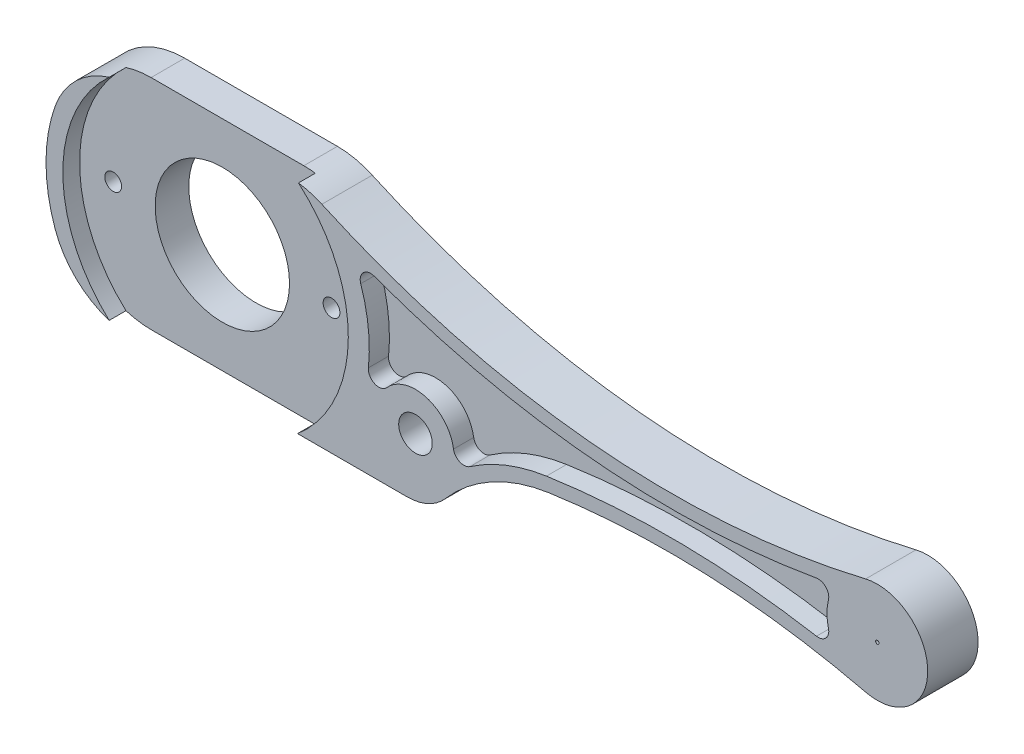
ISO-10303-21;
HEADER;
FILE_DESCRIPTION(('STEP AP214'),'2;1');
FILE_NAME('part.step','',(''),(''),'','','');
FILE_SCHEMA(('AUTOMOTIVE_DESIGN { 1 0 10303 214 1 1 1 1 }'));
ENDSEC;
DATA;
#1=APPLICATION_CONTEXT('core data for automotive mechanical design processes');
#2=APPLICATION_PROTOCOL_DEFINITION('international standard','automotive_design',2000,#1);
#3=PRODUCT_CONTEXT('',#1,'mechanical');
#4=PRODUCT('Part','Part','',(#3));
#5=PRODUCT_RELATED_PRODUCT_CATEGORY('part','',(#4));
#6=PRODUCT_DEFINITION_FORMATION('','',#4);
#7=PRODUCT_DEFINITION_CONTEXT('part definition',#1,'design');
#8=PRODUCT_DEFINITION('design','',#6,#7);
#9=PRODUCT_DEFINITION_SHAPE('','',#8);
#10=(LENGTH_UNIT() NAMED_UNIT(*) SI_UNIT(.MILLI.,.METRE.));
#11=(NAMED_UNIT(*) PLANE_ANGLE_UNIT() SI_UNIT($,.RADIAN.));
#12=(NAMED_UNIT(*) SI_UNIT($,.STERADIAN.) SOLID_ANGLE_UNIT());
#13=UNCERTAINTY_MEASURE_WITH_UNIT(LENGTH_MEASURE(1.E-05),#10,'distance_accuracy_value','');
#14=(GEOMETRIC_REPRESENTATION_CONTEXT(3) GLOBAL_UNCERTAINTY_ASSIGNED_CONTEXT((#13)) GLOBAL_UNIT_ASSIGNED_CONTEXT((#10,
#11,#12)) REPRESENTATION_CONTEXT('',''));
#15=CARTESIAN_POINT('',(0.,0.,0.));
#16=DIRECTION('',(0.,0.,1.));
#17=DIRECTION('',(1.,0.,0.));
#18=AXIS2_PLACEMENT_3D('',#15,#16,#17);
#19=CARTESIAN_POINT('',(-15.,-15.,6.));
#20=DIRECTION('',(0.,0.,-1.));
#21=DIRECTION('',(1.,0.,0.));
#22=AXIS2_PLACEMENT_3D('',#19,#20,#21);
#23=PLANE('',#22);
#24=CARTESIAN_POINT('',(0.,0.,6.));
#25=DIRECTION('',(0.,0.,1.));
#26=DIRECTION('',(1.,0.,0.));
#27=AXIS2_PLACEMENT_3D('',#24,#25,#26);
#28=CIRCLE('',#27,9.5);
#29=CARTESIAN_POINT('',(-8.9566858950296,3.16666666666667,6.));
#30=VERTEX_POINT('',#29);
#31=CARTESIAN_POINT('',(-8.9566858950296,-3.16666666666667,6.));
#32=VERTEX_POINT('',#31);
#33=EDGE_CURVE('E274',#30,#32,#28,.T.);
#34=ORIENTED_EDGE('',*,*,#33,.T.);
#35=CARTESIAN_POINT('',(-4.24264068711928,-1.5,6.));
#36=DIRECTION('',(0.,0.,1.));
#37=DIRECTION('',(-1.,0.,0.));
#38=AXIS2_PLACEMENT_3D('',#35,#36,#37);
#39=CIRCLE('',#38,5.);
#40=CARTESIAN_POINT('',(-5.73773447853214,-6.27123616632825,6.));
#41=VERTEX_POINT('',#40);
#42=EDGE_CURVE('E277',#32,#41,#39,.T.);
#43=ORIENTED_EDGE('',*,*,#42,.T.);
#44=CARTESIAN_POINT('',(0.,0.,6.));
#45=DIRECTION('',(0.,0.,1.));
#46=DIRECTION('',(1.,0.,0.));
#47=AXIS2_PLACEMENT_3D('',#44,#45,#46);
#48=CIRCLE('',#47,8.5);
#49=CARTESIAN_POINT('',(-5.73773447853214,6.27123616632825,6.));
#50=VERTEX_POINT('',#49);
#51=EDGE_CURVE('E331',#50,#41,#48,.T.);
#52=ORIENTED_EDGE('',*,*,#51,.F.);
#53=CARTESIAN_POINT('',(-4.24264068711928,1.5,6.));
#54=DIRECTION('',(0.,0.,1.));
#55=DIRECTION('',(1.,0.,0.));
#56=AXIS2_PLACEMENT_3D('',#53,#54,#55);
#57=CIRCLE('',#56,5.);
#58=EDGE_CURVE('E271',#50,#30,#57,.T.);
#59=ORIENTED_EDGE('',*,*,#58,.T.);
#60=EDGE_LOOP('',(#34,#43,#52,#59));
#61=FACE_BOUND('',#60,.T.);
#62=ADVANCED_FACE('F33',(#61),#23,.F.);
#63=CARTESIAN_POINT('',(0.,0.,5.));
#64=DIRECTION('',(0.,0.,1.));
#65=DIRECTION('',(-1.,0.,0.));
#66=AXIS2_PLACEMENT_3D('',#63,#64,#65);
#67=CYLINDRICAL_SURFACE('',#66,8.5);
#68=DIRECTION('',(0.,0.,1.));
#69=VECTOR('',#68,1.);
#70=CARTESIAN_POINT('',(5.53211423569837,6.45334890449784,4.5));
#71=LINE('',#70,#69);
#72=CARTESIAN_POINT('',(5.53211423569837,6.45334890449784,6.));
#73=VERTEX_POINT('',#72);
#74=CARTESIAN_POINT('',(5.53211423569837,6.45334890449784,5.));
#75=VERTEX_POINT('',#74);
#76=EDGE_CURVE('E41',#73,#75,#71,.F.);
#77=ORIENTED_EDGE('',*,*,#76,.T.);
#78=CARTESIAN_POINT('',(0.,0.,5.));
#79=DIRECTION('',(0.,0.,1.));
#80=DIRECTION('',(1.,0.,0.));
#81=AXIS2_PLACEMENT_3D('',#78,#79,#80);
#82=CIRCLE('',#81,8.5);
#83=CARTESIAN_POINT('',(5.47722557505166,-6.5,5.));
#84=VERTEX_POINT('',#83);
#85=EDGE_CURVE('E327',#84,#75,#82,.T.);
#86=ORIENTED_EDGE('',*,*,#85,.F.);
#87=DIRECTION('',(0.,0.,1.));
#88=VECTOR('',#87,1.);
#89=CARTESIAN_POINT('',(5.47722557505166,-6.5,5.));
#90=LINE('',#89,#88);
#91=CARTESIAN_POINT('',(5.47722557505166,-6.5,6.));
#92=VERTEX_POINT('',#91);
#93=EDGE_CURVE('E362',#84,#92,#90,.T.);
#94=ORIENTED_EDGE('',*,*,#93,.T.);
#95=EDGE_CURVE('E326',#92,#73,#48,.T.);
#96=ORIENTED_EDGE('',*,*,#95,.T.);
#97=EDGE_LOOP('',(#77,#86,#94,#96));
#98=FACE_BOUND('',#97,.T.);
#99=ADVANCED_FACE('F374',(#98),#67,.F.);
#100=CARTESIAN_POINT('',(15.3842180039987,-2.55797359602946,6.));
#101=DIRECTION('',(0.,0.,1.));
#102=DIRECTION('',(1.,0.,0.));
#103=AXIS2_PLACEMENT_3D('',#100,#101,#102);
#104=CIRCLE('',#103,0.625000000000002);
#105=CARTESIAN_POINT('',(14.7664310881251,-2.6526537236984,6.));
#106=VERTEX_POINT('',#105);
#107=CARTESIAN_POINT('',(15.7386882696293,-3.07273162732552,6.));
#108=VERTEX_POINT('',#107);
#109=EDGE_CURVE('E224',#106,#108,#104,.T.);
#110=ORIENTED_EDGE('',*,*,#109,.F.);
#111=CARTESIAN_POINT('',(12.5,-3.,6.));
#112=DIRECTION('',(0.,0.,1.));
#113=DIRECTION('',(1.,0.,0.));
#114=AXIS2_PLACEMENT_3D('',#111,#112,#113);
#115=CIRCLE('',#114,2.29289321881345);
#116=CARTESIAN_POINT('',(10.7875312379464,-1.4752672195197,6.));
#117=VERTEX_POINT('',#116);
#118=EDGE_CURVE('E457',#106,#117,#115,.T.);
#119=ORIENTED_EDGE('',*,*,#118,.T.);
#120=CARTESIAN_POINT('',(10.3207441379185,-1.05965345260677,6.));
#121=DIRECTION('',(0.,0.,1.));
#122=DIRECTION('',(1.,0.,0.));
#123=AXIS2_PLACEMENT_3D('',#120,#121,#122);
#124=CIRCLE('',#123,0.625);
#125=CARTESIAN_POINT('',(9.69901256334507,-0.995818907269018,6.));
#126=VERTEX_POINT('',#125);
#127=EDGE_CURVE('E460',#126,#117,#124,.T.);
#128=ORIENTED_EDGE('',*,*,#127,.F.);
#129=CARTESIAN_POINT('',(0.,0.,6.));
#130=DIRECTION('',(0.,0.,1.));
#131=DIRECTION('',(1.,0.,0.));
#132=AXIS2_PLACEMENT_3D('',#129,#130,#131);
#133=CIRCLE('',#132,9.75);
#134=CARTESIAN_POINT('',(9.24022420282149,3.11139143818197,6.));
#135=VERTEX_POINT('',#134);
#136=EDGE_CURVE('E507',#126,#135,#133,.T.);
#137=ORIENTED_EDGE('',*,*,#136,.T.);
#138=CARTESIAN_POINT('',(9.83254626710492,3.3108396072962,6.));
#139=DIRECTION('',(0.,0.,1.));
#140=DIRECTION('',(1.,0.,0.));
#141=AXIS2_PLACEMENT_3D('',#138,#139,#140);
#142=CIRCLE('',#141,0.625);
#143=CARTESIAN_POINT('',(10.0492827611848,3.89705653995334,6.));
#144=VERTEX_POINT('',#143);
#145=EDGE_CURVE('E504',#144,#135,#142,.T.);
#146=ORIENTED_EDGE('',*,*,#145,.F.);
#147=CARTESIAN_POINT('',(27.665625,51.5447688263259,6.));
#148=DIRECTION('',(0.,0.,1.));
#149=DIRECTION('',(1.,0.,0.));
#150=AXIS2_PLACEMENT_3D('',#147,#148,#149);
#151=CIRCLE('',#150,50.8);
#152=CARTESIAN_POINT('',(36.3766297245662,1.49720748025643,6.));
#153=VERTEX_POINT('',#152);
#154=EDGE_CURVE('E499',#144,#153,#151,.T.);
#155=ORIENTED_EDGE('',*,*,#154,.T.);
#156=CARTESIAN_POINT('',(36.4838025189137,0.881464845585303,6.));
#157=DIRECTION('',(0.,0.,1.));
#158=DIRECTION('',(1.,0.,0.));
#159=AXIS2_PLACEMENT_3D('',#156,#157,#158);
#160=CIRCLE('',#159,0.624999999999998);
#161=CARTESIAN_POINT('',(37.0900434639286,0.729488148070596,6.));
#162=VERTEX_POINT('',#161);
#163=EDGE_CURVE('E497',#162,#153,#160,.T.);
#164=ORIENTED_EDGE('',*,*,#163,.F.);
#165=CARTESIAN_POINT('',(40.,0.,6.));
#166=DIRECTION('',(0.,0.,1.));
#167=DIRECTION('',(1.,0.,0.));
#168=AXIS2_PLACEMENT_3D('',#165,#166,#167);
#169=CIRCLE('',#168,3.00000000000001);
#170=CARTESIAN_POINT('',(37.0900434639286,-0.729488148070595,6.));
#171=VERTEX_POINT('',#170);
#172=EDGE_CURVE('E485',#162,#171,#169,.T.);
#173=ORIENTED_EDGE('',*,*,#172,.T.);
#174=CARTESIAN_POINT('',(36.4838025189137,-0.881464845585303,6.));
#175=DIRECTION('',(0.,0.,1.));
#176=DIRECTION('',(1.,0.,0.));
#177=AXIS2_PLACEMENT_3D('',#174,#175,#176);
#178=CIRCLE('',#177,0.624999999999998);
#179=CARTESIAN_POINT('',(36.3766297245662,-1.49720748025643,6.));
#180=VERTEX_POINT('',#179);
#181=EDGE_CURVE('E491',#180,#171,#178,.T.);
#182=ORIENTED_EDGE('',*,*,#181,.F.);
#183=CARTESIAN_POINT('',(27.665625,-51.5447688263259,6.));
#184=DIRECTION('',(0.,0.,1.));
#185=DIRECTION('',(1.,0.,0.));
#186=AXIS2_PLACEMENT_3D('',#183,#184,#185);
#187=CIRCLE('',#186,50.8);
#188=CARTESIAN_POINT('',(20.2974780138513,-1.28195543520632,6.));
#189=VERTEX_POINT('',#188);
#190=EDGE_CURVE('E493',#180,#189,#187,.T.);
#191=ORIENTED_EDGE('',*,*,#190,.T.);
#192=CARTESIAN_POINT('',(21.8639344597254,-11.9677504081215,6.));
#193=DIRECTION('',(0.,0.,1.));
#194=DIRECTION('',(1.,0.,0.));
#195=AXIS2_PLACEMENT_3D('',#192,#193,#194);
#196=CIRCLE('',#195,10.8);
#197=EDGE_CURVE('E227',#189,#108,#196,.T.);
#198=ORIENTED_EDGE('',*,*,#197,.T.);
#199=EDGE_LOOP('',(#110,#119,#128,#137,#146,#155,#164,#173,#182,#191,#198));
#200=FACE_BOUND('',#199,.T.);
#201=ORIENTED_EDGE('',*,*,#95,.F.);
#202=DIRECTION('',(1.,0.,0.));
#203=VECTOR('',#202,1.);
#204=CARTESIAN_POINT('',(-4.24264068711928,-6.5,6.));
#205=LINE('',#204,#203);
#206=CARTESIAN_POINT('',(12.,-6.5,6.));
#207=VERTEX_POINT('',#206);
#208=EDGE_CURVE('E280',#92,#207,#205,.T.);
#209=ORIENTED_EDGE('',*,*,#208,.T.);
#210=CARTESIAN_POINT('',(12.,-3.5,6.));
#211=DIRECTION('',(0.,0.,1.));
#212=DIRECTION('',(1.,0.,0.));
#213=AXIS2_PLACEMENT_3D('',#210,#211,#212);
#214=CIRCLE('',#213,3.);
#215=CARTESIAN_POINT('',(14.2762925676289,-5.45409624802804,6.));
#216=VERTEX_POINT('',#215);
#217=EDGE_CURVE('E283',#207,#216,#214,.T.);
#218=ORIENTED_EDGE('',*,*,#217,.T.);
#219=CARTESIAN_POINT('',(21.8639344597254,-11.9677504081215,6.));
#220=DIRECTION('',(0.,0.,-1.));
#221=DIRECTION('',(-1.,0.,0.));
#222=AXIS2_PLACEMENT_3D('',#219,#220,#221);
#223=CIRCLE('',#222,10.);
#224=CARTESIAN_POINT('',(20.4135118246568,-2.0734958035704,6.));
#225=VERTEX_POINT('',#224);
#226=EDGE_CURVE('E286',#216,#225,#223,.T.);
#227=ORIENTED_EDGE('',*,*,#226,.T.);
#228=CARTESIAN_POINT('',(27.665625,-51.5447688263259,6.));
#229=DIRECTION('',(0.,0.,-1.));
#230=DIRECTION('',(-1.,0.,0.));
#231=AXIS2_PLACEMENT_3D('',#228,#229,#230);
#232=CIRCLE('',#231,50.);
#233=CARTESIAN_POINT('',(39.3018278301887,-2.91762842413166,6.));
#234=VERTEX_POINT('',#233);
#235=EDGE_CURVE('E289',#225,#234,#232,.T.);
#236=ORIENTED_EDGE('',*,*,#235,.T.);
#237=CARTESIAN_POINT('',(40.,0.,6.));
#238=DIRECTION('',(0.,0.,1.));
#239=DIRECTION('',(1.,0.,0.));
#240=AXIS2_PLACEMENT_3D('',#237,#238,#239);
#241=CIRCLE('',#240,3.00000000000001);
#242=CARTESIAN_POINT('',(39.3018278301887,2.91762842413166,6.));
#243=VERTEX_POINT('',#242);
#244=EDGE_CURVE('E241',#234,#243,#241,.T.);
#245=ORIENTED_EDGE('',*,*,#244,.T.);
#246=CARTESIAN_POINT('',(27.665625,51.5447688263259,6.));
#247=DIRECTION('',(0.,0.,-1.));
#248=DIRECTION('',(1.,0.,0.));
#249=AXIS2_PLACEMENT_3D('',#246,#247,#248);
#250=CIRCLE('',#249,50.);
#251=CARTESIAN_POINT('',(6.9247779074781,6.0495244387569,6.));
#252=VERTEX_POINT('',#251);
#253=EDGE_CURVE('E229',#243,#252,#250,.T.);
#254=ORIENTED_EDGE('',*,*,#253,.T.);
#255=CARTESIAN_POINT('',(4.85069319822591,1.5,6.));
#256=DIRECTION('',(0.,0.,1.));
#257=DIRECTION('',(1.,0.,0.));
#258=AXIS2_PLACEMENT_3D('',#255,#256,#257);
#259=CIRCLE('',#258,5.);
#260=EDGE_CURVE('E232',#252,#73,#259,.T.);
#261=ORIENTED_EDGE('',*,*,#260,.T.);
#262=EDGE_LOOP('',(#201,#209,#218,#227,#236,#245,#254,#261));
#263=FACE_BOUND('',#262,.T.);
#264=CARTESIAN_POINT('',(40.,0.,6.));
#265=DIRECTION('',(0.,0.,1.));
#266=DIRECTION('',(1.,0.,0.));
#267=AXIS2_PLACEMENT_3D('',#264,#265,#266);
#268=CIRCLE('',#267,0.100000000000001);
#269=CARTESIAN_POINT('',(40.1,0.,6.));
#270=VERTEX_POINT('',#269);
#271=EDGE_CURVE('E353',#270,#270,#268,.T.);
#272=ORIENTED_EDGE('',*,*,#271,.F.);
#273=EDGE_LOOP('',(#272));
#274=FACE_BOUND('',#273,.T.);
#275=CARTESIAN_POINT('',(12.5,-3.,6.));
#276=DIRECTION('',(0.,0.,-1.));
#277=DIRECTION('',(-1.,0.,0.));
#278=AXIS2_PLACEMENT_3D('',#275,#276,#277);
#279=CIRCLE('',#278,0.999999999999999);
#280=CARTESIAN_POINT('',(11.5,-3.,6.));
#281=VERTEX_POINT('',#280);
#282=EDGE_CURVE('E344',#281,#281,#279,.T.);
#283=ORIENTED_EDGE('',*,*,#282,.T.);
#284=EDGE_LOOP('',(#283));
#285=FACE_BOUND('',#284,.T.);
#286=ADVANCED_FACE('F35',(#200,#263,#274,#285),#23,.F.);
#287=CARTESIAN_POINT('',(-15.,-15.,3.));
#288=DIRECTION('',(0.,0.,-1.));
#289=DIRECTION('',(1.,0.,0.));
#290=AXIS2_PLACEMENT_3D('',#287,#288,#289);
#291=PLANE('',#290);
#292=CARTESIAN_POINT('',(27.665625,51.5447688263259,3.));
#293=DIRECTION('',(0.,0.,-1.));
#294=DIRECTION('',(1.,0.,0.));
#295=AXIS2_PLACEMENT_3D('',#292,#293,#294);
#296=CIRCLE('',#295,50.);
#297=CARTESIAN_POINT('',(39.3018278301887,2.91762842413166,3.));
#298=VERTEX_POINT('',#297);
#299=CARTESIAN_POINT('',(6.9247779074781,6.0495244387569,3.));
#300=VERTEX_POINT('',#299);
#301=EDGE_CURVE('E238',#298,#300,#296,.T.);
#302=ORIENTED_EDGE('',*,*,#301,.F.);
#303=CARTESIAN_POINT('',(40.,0.,3.));
#304=DIRECTION('',(0.,0.,1.));
#305=DIRECTION('',(1.,0.,0.));
#306=AXIS2_PLACEMENT_3D('',#303,#304,#305);
#307=CIRCLE('',#306,3.00000000000001);
#308=CARTESIAN_POINT('',(39.3018278301887,-2.91762842413166,3.));
#309=VERTEX_POINT('',#308);
#310=EDGE_CURVE('E268',#309,#298,#307,.T.);
#311=ORIENTED_EDGE('',*,*,#310,.F.);
#312=CARTESIAN_POINT('',(27.665625,-51.5447688263259,3.));
#313=DIRECTION('',(0.,0.,-1.));
#314=DIRECTION('',(-1.,0.,0.));
#315=AXIS2_PLACEMENT_3D('',#312,#313,#314);
#316=CIRCLE('',#315,50.);
#317=CARTESIAN_POINT('',(20.4135118246568,-2.0734958035704,3.));
#318=VERTEX_POINT('',#317);
#319=EDGE_CURVE('E265',#318,#309,#316,.T.);
#320=ORIENTED_EDGE('',*,*,#319,.F.);
#321=CARTESIAN_POINT('',(21.8639344597254,-11.9677504081215,3.));
#322=DIRECTION('',(0.,0.,-1.));
#323=DIRECTION('',(-1.,0.,0.));
#324=AXIS2_PLACEMENT_3D('',#321,#322,#323);
#325=CIRCLE('',#324,10.);
#326=CARTESIAN_POINT('',(14.2762925676289,-5.45409624802804,3.));
#327=VERTEX_POINT('',#326);
#328=EDGE_CURVE('E262',#327,#318,#325,.T.);
#329=ORIENTED_EDGE('',*,*,#328,.F.);
#330=CARTESIAN_POINT('',(12.,-3.5,3.));
#331=DIRECTION('',(0.,0.,1.));
#332=DIRECTION('',(1.,0.,0.));
#333=AXIS2_PLACEMENT_3D('',#330,#331,#332);
#334=CIRCLE('',#333,3.);
#335=CARTESIAN_POINT('',(12.,-6.5,3.));
#336=VERTEX_POINT('',#335);
#337=EDGE_CURVE('E259',#336,#327,#334,.T.);
#338=ORIENTED_EDGE('',*,*,#337,.F.);
#339=DIRECTION('',(1.,0.,0.));
#340=VECTOR('',#339,1.);
#341=CARTESIAN_POINT('',(-4.24264068711928,-6.5,3.));
#342=LINE('',#341,#340);
#343=CARTESIAN_POINT('',(-4.24264068711928,-6.5,3.));
#344=VERTEX_POINT('',#343);
#345=EDGE_CURVE('E256',#344,#336,#342,.T.);
#346=ORIENTED_EDGE('',*,*,#345,.F.);
#347=CARTESIAN_POINT('',(-4.24264068711928,-1.5,3.));
#348=DIRECTION('',(0.,0.,1.));
#349=DIRECTION('',(-1.,0.,0.));
#350=AXIS2_PLACEMENT_3D('',#347,#348,#349);
#351=CIRCLE('',#350,5.);
#352=CARTESIAN_POINT('',(-8.9566858950296,-3.16666666666667,3.));
#353=VERTEX_POINT('',#352);
#354=EDGE_CURVE('E253',#353,#344,#351,.T.);
#355=ORIENTED_EDGE('',*,*,#354,.F.);
#356=CARTESIAN_POINT('',(0.,0.,3.));
#357=DIRECTION('',(0.,0.,1.));
#358=DIRECTION('',(1.,0.,0.));
#359=AXIS2_PLACEMENT_3D('',#356,#357,#358);
#360=CIRCLE('',#359,9.5);
#361=CARTESIAN_POINT('',(-8.9566858950296,3.16666666666667,3.));
#362=VERTEX_POINT('',#361);
#363=EDGE_CURVE('E250',#362,#353,#360,.T.);
#364=ORIENTED_EDGE('',*,*,#363,.F.);
#365=CARTESIAN_POINT('',(-4.24264068711928,1.5,3.));
#366=DIRECTION('',(0.,0.,1.));
#367=DIRECTION('',(1.,0.,0.));
#368=AXIS2_PLACEMENT_3D('',#365,#366,#367);
#369=CIRCLE('',#368,5.);
#370=CARTESIAN_POINT('',(-4.24264068711928,6.5,3.));
#371=VERTEX_POINT('',#370);
#372=EDGE_CURVE('E247',#371,#362,#369,.T.);
#373=ORIENTED_EDGE('',*,*,#372,.F.);
#374=DIRECTION('',(-1.,0.,0.));
#375=VECTOR('',#374,1.);
#376=CARTESIAN_POINT('',(-4.24264068711928,6.5,3.));
#377=LINE('',#376,#375);
#378=CARTESIAN_POINT('',(4.85069319822591,6.5,3.));
#379=VERTEX_POINT('',#378);
#380=EDGE_CURVE('E244',#379,#371,#377,.T.);
#381=ORIENTED_EDGE('',*,*,#380,.F.);
#382=CARTESIAN_POINT('',(4.85069319822591,1.5,3.));
#383=DIRECTION('',(0.,0.,1.));
#384=DIRECTION('',(1.,0.,0.));
#385=AXIS2_PLACEMENT_3D('',#382,#383,#384);
#386=CIRCLE('',#385,5.);
#387=EDGE_CURVE('E240',#300,#379,#386,.T.);
#388=ORIENTED_EDGE('',*,*,#387,.F.);
#389=EDGE_LOOP('',(#302,#311,#320,#329,#338,#346,#355,#364,#373,#381,#388));
#390=FACE_BOUND('',#389,.T.);
#391=CARTESIAN_POINT('',(12.5,-3.,3.));
#392=DIRECTION('',(0.,0.,-1.));
#393=DIRECTION('',(-1.,0.,0.));
#394=AXIS2_PLACEMENT_3D('',#391,#392,#393);
#395=CIRCLE('',#394,0.999999999999999);
#396=CARTESIAN_POINT('',(11.5,-3.,3.));
#397=VERTEX_POINT('',#396);
#398=EDGE_CURVE('E341',#397,#397,#395,.T.);
#399=ORIENTED_EDGE('',*,*,#398,.F.);
#400=EDGE_LOOP('',(#399));
#401=FACE_BOUND('',#400,.T.);
#402=CARTESIAN_POINT('',(-6.5,0.,3.));
#403=DIRECTION('',(0.,0.,-1.));
#404=DIRECTION('',(-1.,0.,0.));
#405=AXIS2_PLACEMENT_3D('',#402,#403,#404);
#406=CIRCLE('',#405,0.499999999999999);
#407=CARTESIAN_POINT('',(-7.,0.,3.));
#408=VERTEX_POINT('',#407);
#409=EDGE_CURVE('E347',#408,#408,#406,.T.);
#410=ORIENTED_EDGE('',*,*,#409,.F.);
#411=EDGE_LOOP('',(#410));
#412=FACE_BOUND('',#411,.T.);
#413=CARTESIAN_POINT('',(6.5,0.,3.));
#414=DIRECTION('',(0.,0.,-1.));
#415=DIRECTION('',(-1.,0.,0.));
#416=AXIS2_PLACEMENT_3D('',#413,#414,#415);
#417=CIRCLE('',#416,0.499999999999999);
#418=CARTESIAN_POINT('',(6.,0.,3.));
#419=VERTEX_POINT('',#418);
#420=EDGE_CURVE('E350',#419,#419,#417,.T.);
#421=ORIENTED_EDGE('',*,*,#420,.F.);
#422=EDGE_LOOP('',(#421));
#423=FACE_BOUND('',#422,.T.);
#424=CARTESIAN_POINT('',(0.,0.,3.));
#425=DIRECTION('',(0.,0.,1.));
#426=DIRECTION('',(1.,0.,0.));
#427=AXIS2_PLACEMENT_3D('',#424,#425,#426);
#428=CIRCLE('',#427,4.);
#429=CARTESIAN_POINT('',(4.,0.,3.));
#430=VERTEX_POINT('',#429);
#431=EDGE_CURVE('E357',#430,#430,#428,.T.);
#432=ORIENTED_EDGE('',*,*,#431,.T.);
#433=EDGE_LOOP('',(#432));
#434=FACE_BOUND('',#433,.T.);
#435=CARTESIAN_POINT('',(40.,0.,3.));
#436=DIRECTION('',(0.,0.,1.));
#437=DIRECTION('',(1.,0.,0.));
#438=AXIS2_PLACEMENT_3D('',#435,#436,#437);
#439=CIRCLE('',#438,0.100000000000001);
#440=CARTESIAN_POINT('',(40.1,0.,3.));
#441=VERTEX_POINT('',#440);
#442=EDGE_CURVE('E354',#441,#441,#439,.T.);
#443=ORIENTED_EDGE('',*,*,#442,.T.);
#444=EDGE_LOOP('',(#443));
#445=FACE_BOUND('',#444,.T.);
#446=ADVANCED_FACE('F398',(#390,#401,#412,#423,#434,#445),#291,.T.);
#447=CARTESIAN_POINT('',(0.,0.,3.));
#448=DIRECTION('',(0.,0.,1.));
#449=DIRECTION('',(-1.,0.,0.));
#450=AXIS2_PLACEMENT_3D('',#447,#448,#449);
#451=CYLINDRICAL_SURFACE('',#450,4.);
#452=CARTESIAN_POINT('',(0.,0.,5.));
#453=DIRECTION('',(0.,0.,1.));
#454=DIRECTION('',(1.,0.,0.));
#455=AXIS2_PLACEMENT_3D('',#452,#453,#454);
#456=CIRCLE('',#455,4.);
#457=CARTESIAN_POINT('',(4.,0.,5.));
#458=VERTEX_POINT('',#457);
#459=EDGE_CURVE('E337',#458,#458,#456,.T.);
#460=ORIENTED_EDGE('',*,*,#459,.T.);
#461=EDGE_LOOP('',(#460));
#462=FACE_BOUND('',#461,.T.);
#463=ORIENTED_EDGE('',*,*,#431,.F.);
#464=EDGE_LOOP('',(#463));
#465=FACE_BOUND('',#464,.T.);
#466=ADVANCED_FACE('F451',(#462,#465),#451,.F.);
#467=CARTESIAN_POINT('',(40.,0.,3.));
#468=DIRECTION('',(0.,0.,1.));
#469=DIRECTION('',(-1.,0.,0.));
#470=AXIS2_PLACEMENT_3D('',#467,#468,#469);
#471=CYLINDRICAL_SURFACE('',#470,0.100000000000001);
#472=ORIENTED_EDGE('',*,*,#442,.F.);
#473=EDGE_LOOP('',(#472));
#474=FACE_BOUND('',#473,.T.);
#475=ORIENTED_EDGE('',*,*,#271,.T.);
#476=EDGE_LOOP('',(#475));
#477=FACE_BOUND('',#476,.T.);
#478=ADVANCED_FACE('F759',(#474,#477),#471,.F.);
#479=CARTESIAN_POINT('',(6.5,0.,6.));
#480=DIRECTION('',(0.,0.,1.));
#481=DIRECTION('',(-1.,0.,0.));
#482=AXIS2_PLACEMENT_3D('',#479,#480,#481);
#483=CYLINDRICAL_SURFACE('',#482,0.499999999999999);
#484=CARTESIAN_POINT('',(6.5,0.,5.));
#485=DIRECTION('',(0.,0.,1.));
#486=DIRECTION('',(1.,0.,0.));
#487=AXIS2_PLACEMENT_3D('',#484,#485,#486);
#488=CIRCLE('',#487,0.499999999999999);
#489=CARTESIAN_POINT('',(7.,0.,5.));
#490=VERTEX_POINT('',#489);
#491=EDGE_CURVE('E334',#490,#490,#488,.F.);
#492=ORIENTED_EDGE('',*,*,#491,.F.);
#493=EDGE_LOOP('',(#492));
#494=FACE_BOUND('',#493,.T.);
#495=ORIENTED_EDGE('',*,*,#420,.T.);
#496=EDGE_LOOP('',(#495));
#497=FACE_BOUND('',#496,.T.);
#498=ADVANCED_FACE('F750',(#494,#497),#483,.F.);
#499=CARTESIAN_POINT('',(-6.5,0.,6.));
#500=DIRECTION('',(0.,0.,1.));
#501=DIRECTION('',(-1.,0.,0.));
#502=AXIS2_PLACEMENT_3D('',#499,#500,#501);
#503=CYLINDRICAL_SURFACE('',#502,0.499999999999999);
#504=CARTESIAN_POINT('',(-6.5,0.,5.));
#505=DIRECTION('',(0.,0.,1.));
#506=DIRECTION('',(1.,0.,0.));
#507=AXIS2_PLACEMENT_3D('',#504,#505,#506);
#508=CIRCLE('',#507,0.499999999999999);
#509=CARTESIAN_POINT('',(-6.,0.,5.));
#510=VERTEX_POINT('',#509);
#511=EDGE_CURVE('E338',#510,#510,#508,.F.);
#512=ORIENTED_EDGE('',*,*,#511,.F.);
#513=EDGE_LOOP('',(#512));
#514=FACE_BOUND('',#513,.T.);
#515=ORIENTED_EDGE('',*,*,#409,.T.);
#516=EDGE_LOOP('',(#515));
#517=FACE_BOUND('',#516,.T.);
#518=ADVANCED_FACE('F741',(#514,#517),#503,.F.);
#519=CARTESIAN_POINT('',(12.5,-3.,6.));
#520=DIRECTION('',(0.,0.,1.));
#521=DIRECTION('',(-1.,0.,0.));
#522=AXIS2_PLACEMENT_3D('',#519,#520,#521);
#523=CYLINDRICAL_SURFACE('',#522,0.999999999999999);
#524=ORIENTED_EDGE('',*,*,#398,.T.);
#525=EDGE_LOOP('',(#524));
#526=FACE_BOUND('',#525,.T.);
#527=ORIENTED_EDGE('',*,*,#282,.F.);
#528=EDGE_LOOP('',(#527));
#529=FACE_BOUND('',#528,.T.);
#530=ADVANCED_FACE('F732',(#526,#529),#523,.F.);
#531=CARTESIAN_POINT('',(0.,0.,5.));
#532=DIRECTION('',(0.,0.,-1.));
#533=DIRECTION('',(1.,0.,0.));
#534=AXIS2_PLACEMENT_3D('',#531,#532,#533);
#535=PLANE('',#534);
#536=ORIENTED_EDGE('',*,*,#459,.F.);
#537=EDGE_LOOP('',(#536));
#538=FACE_BOUND('',#537,.T.);
#539=ORIENTED_EDGE('',*,*,#511,.T.);
#540=EDGE_LOOP('',(#539));
#541=FACE_BOUND('',#540,.T.);
#542=DIRECTION('',(1.,0.,0.));
#543=VECTOR('',#542,1.);
#544=CARTESIAN_POINT('',(0.,6.5,5.));
#545=LINE('',#544,#543);
#546=CARTESIAN_POINT('',(-4.24264068711928,6.5,5.));
#547=VERTEX_POINT('',#546);
#548=CARTESIAN_POINT('',(4.85069319822591,6.5,5.));
#549=VERTEX_POINT('',#548);
#550=EDGE_CURVE('E12',#547,#549,#545,.T.);
#551=ORIENTED_EDGE('',*,*,#550,.F.);
#552=CARTESIAN_POINT('',(-4.24264068711928,1.5,5.));
#553=DIRECTION('',(0.,0.,1.));
#554=DIRECTION('',(1.,0.,0.));
#555=AXIS2_PLACEMENT_3D('',#552,#553,#554);
#556=CIRCLE('',#555,5.);
#557=CARTESIAN_POINT('',(-5.73773447853214,6.27123616632825,5.));
#558=VERTEX_POINT('',#557);
#559=EDGE_CURVE('E321',#558,#547,#556,.F.);
#560=ORIENTED_EDGE('',*,*,#559,.F.);
#561=CARTESIAN_POINT('',(-5.73773447853214,-6.27123616632826,5.));
#562=VERTEX_POINT('',#561);
#563=EDGE_CURVE('E330',#558,#562,#82,.T.);
#564=ORIENTED_EDGE('',*,*,#563,.T.);
#565=CARTESIAN_POINT('',(-4.24264068711928,-1.5,5.));
#566=DIRECTION('',(0.,0.,1.));
#567=DIRECTION('',(1.,0.,0.));
#568=AXIS2_PLACEMENT_3D('',#565,#566,#567);
#569=CIRCLE('',#568,5.);
#570=CARTESIAN_POINT('',(-4.24264068711928,-6.5,5.));
#571=VERTEX_POINT('',#570);
#572=EDGE_CURVE('E318',#571,#562,#569,.F.);
#573=ORIENTED_EDGE('',*,*,#572,.F.);
#574=DIRECTION('',(-1.,0.,0.));
#575=VECTOR('',#574,1.);
#576=CARTESIAN_POINT('',(0.,-6.5,5.));
#577=LINE('',#576,#575);
#578=EDGE_CURVE('E315',#84,#571,#577,.T.);
#579=ORIENTED_EDGE('',*,*,#578,.F.);
#580=ORIENTED_EDGE('',*,*,#85,.T.);
#581=CARTESIAN_POINT('',(4.85069319822591,1.5,5.));
#582=DIRECTION('',(0.,0.,1.));
#583=DIRECTION('',(1.,0.,0.));
#584=AXIS2_PLACEMENT_3D('',#581,#582,#583);
#585=CIRCLE('',#584,5.);
#586=EDGE_CURVE('E324',#549,#75,#585,.F.);
#587=ORIENTED_EDGE('',*,*,#586,.F.);
#588=EDGE_LOOP('',(#551,#560,#564,#573,#579,#580,#587));
#589=FACE_BOUND('',#588,.T.);
#590=ORIENTED_EDGE('',*,*,#491,.T.);
#591=EDGE_LOOP('',(#590));
#592=FACE_BOUND('',#591,.T.);
#593=ADVANCED_FACE('F382',(#538,#541,#589,#592),#535,.F.);
#594=DIRECTION('',(0.,0.,1.));
#595=VECTOR('',#594,1.);
#596=CARTESIAN_POINT('',(-5.73773447853215,6.27123616632825,4.5));
#597=LINE('',#596,#595);
#598=EDGE_CURVE('E369',#558,#50,#597,.T.);
#599=ORIENTED_EDGE('',*,*,#598,.T.);
#600=ORIENTED_EDGE('',*,*,#51,.T.);
#601=DIRECTION('',(0.,0.,1.));
#602=VECTOR('',#601,1.);
#603=CARTESIAN_POINT('',(-5.73773447853215,-6.27123616632825,4.5));
#604=LINE('',#603,#602);
#605=EDGE_CURVE('E367',#41,#562,#604,.F.);
#606=ORIENTED_EDGE('',*,*,#605,.T.);
#607=ORIENTED_EDGE('',*,*,#563,.F.);
#608=EDGE_LOOP('',(#599,#600,#606,#607));
#609=FACE_BOUND('',#608,.T.);
#610=ADVANCED_FACE('F413',(#609),#67,.F.);
#611=CARTESIAN_POINT('',(-4.24264068711928,6.5,3.));
#612=DIRECTION('',(0.,-1.,0.));
#613=DIRECTION('',(1.,0.,0.));
#614=AXIS2_PLACEMENT_3D('',#611,#612,#613);
#615=PLANE('',#614);
#616=DIRECTION('',(0.,0.,1.));
#617=VECTOR('',#616,1.);
#618=CARTESIAN_POINT('',(-4.24264068711928,6.5,3.));
#619=LINE('',#618,#617);
#620=EDGE_CURVE('E309',#371,#547,#619,.T.);
#621=ORIENTED_EDGE('',*,*,#620,.T.);
#622=ORIENTED_EDGE('',*,*,#550,.T.);
#623=DIRECTION('',(0.,0.,1.));
#624=VECTOR('',#623,1.);
#625=CARTESIAN_POINT('',(4.85069319822591,6.5,3.));
#626=LINE('',#625,#624);
#627=EDGE_CURVE('E311',#379,#549,#626,.T.);
#628=ORIENTED_EDGE('',*,*,#627,.F.);
#629=ORIENTED_EDGE('',*,*,#380,.T.);
#630=EDGE_LOOP('',(#621,#622,#628,#629));
#631=FACE_BOUND('',#630,.T.);
#632=ADVANCED_FACE('F404',(#631),#615,.F.);
#633=CARTESIAN_POINT('',(4.85069319822591,1.5,3.));
#634=DIRECTION('',(0.,0.,1.));
#635=DIRECTION('',(-1.,0.,0.));
#636=AXIS2_PLACEMENT_3D('',#633,#634,#635);
#637=CYLINDRICAL_SURFACE('',#636,5.);
#638=ORIENTED_EDGE('',*,*,#627,.T.);
#639=ORIENTED_EDGE('',*,*,#586,.T.);
#640=ORIENTED_EDGE('',*,*,#76,.F.);
#641=ORIENTED_EDGE('',*,*,#260,.F.);
#642=DIRECTION('',(0.,0.,1.));
#643=VECTOR('',#642,1.);
#644=CARTESIAN_POINT('',(6.9247779074781,6.0495244387569,3.));
#645=LINE('',#644,#643);
#646=EDGE_CURVE('E313',#300,#252,#645,.T.);
#647=ORIENTED_EDGE('',*,*,#646,.F.);
#648=ORIENTED_EDGE('',*,*,#387,.T.);
#649=EDGE_LOOP('',(#638,#639,#640,#641,#647,#648));
#650=FACE_BOUND('',#649,.T.);
#651=ADVANCED_FACE('F378',(#650),#637,.T.);
#652=CARTESIAN_POINT('',(-4.24264068711928,1.5,3.));
#653=DIRECTION('',(0.,0.,1.));
#654=DIRECTION('',(-1.,0.,0.));
#655=AXIS2_PLACEMENT_3D('',#652,#653,#654);
#656=CYLINDRICAL_SURFACE('',#655,5.);
#657=ORIENTED_EDGE('',*,*,#598,.F.);
#658=ORIENTED_EDGE('',*,*,#559,.T.);
#659=ORIENTED_EDGE('',*,*,#620,.F.);
#660=ORIENTED_EDGE('',*,*,#372,.T.);
#661=DIRECTION('',(0.,0.,1.));
#662=VECTOR('',#661,1.);
#663=CARTESIAN_POINT('',(-8.9566858950296,3.16666666666667,3.));
#664=LINE('',#663,#662);
#665=EDGE_CURVE('E307',#362,#30,#664,.T.);
#666=ORIENTED_EDGE('',*,*,#665,.T.);
#667=ORIENTED_EDGE('',*,*,#58,.F.);
#668=EDGE_LOOP('',(#657,#658,#659,#660,#666,#667));
#669=FACE_BOUND('',#668,.T.);
#670=ADVANCED_FACE('F408',(#669),#656,.T.);
#671=CARTESIAN_POINT('',(-4.24264068711928,-1.5,3.));
#672=DIRECTION('',(0.,0.,1.));
#673=DIRECTION('',(-1.,0.,0.));
#674=AXIS2_PLACEMENT_3D('',#671,#672,#673);
#675=CYLINDRICAL_SURFACE('',#674,5.);
#676=DIRECTION('',(0.,0.,1.));
#677=VECTOR('',#676,1.);
#678=CARTESIAN_POINT('',(-4.24264068711928,-6.5,3.));
#679=LINE('',#678,#677);
#680=EDGE_CURVE('E303',#344,#571,#679,.T.);
#681=ORIENTED_EDGE('',*,*,#680,.T.);
#682=ORIENTED_EDGE('',*,*,#572,.T.);
#683=ORIENTED_EDGE('',*,*,#605,.F.);
#684=ORIENTED_EDGE('',*,*,#42,.F.);
#685=DIRECTION('',(0.,0.,1.));
#686=VECTOR('',#685,1.);
#687=CARTESIAN_POINT('',(-8.9566858950296,-3.16666666666667,3.));
#688=LINE('',#687,#686);
#689=EDGE_CURVE('E305',#353,#32,#688,.T.);
#690=ORIENTED_EDGE('',*,*,#689,.F.);
#691=ORIENTED_EDGE('',*,*,#354,.T.);
#692=EDGE_LOOP('',(#681,#682,#683,#684,#690,#691));
#693=FACE_BOUND('',#692,.T.);
#694=ADVANCED_FACE('F416',(#693),#675,.T.);
#695=CARTESIAN_POINT('',(-4.24264068711928,-6.5,3.));
#696=DIRECTION('',(0.,1.,0.));
#697=DIRECTION('',(0.,0.,-1.));
#698=AXIS2_PLACEMENT_3D('',#695,#696,#697);
#699=PLANE('',#698);
#700=ORIENTED_EDGE('',*,*,#93,.F.);
#701=ORIENTED_EDGE('',*,*,#578,.T.);
#702=ORIENTED_EDGE('',*,*,#680,.F.);
#703=ORIENTED_EDGE('',*,*,#345,.T.);
#704=DIRECTION('',(0.,0.,1.));
#705=VECTOR('',#704,1.);
#706=CARTESIAN_POINT('',(12.,-6.5,3.));
#707=LINE('',#706,#705);
#708=EDGE_CURVE('E301',#336,#207,#707,.T.);
#709=ORIENTED_EDGE('',*,*,#708,.T.);
#710=ORIENTED_EDGE('',*,*,#208,.F.);
#711=EDGE_LOOP('',(#700,#701,#702,#703,#709,#710));
#712=FACE_BOUND('',#711,.T.);
#713=ADVANCED_FACE('F388',(#712),#699,.F.);
#714=CARTESIAN_POINT('',(27.665625,51.5447688263259,3.));
#715=DIRECTION('',(0.,0.,1.));
#716=DIRECTION('',(-1.,0.,0.));
#717=AXIS2_PLACEMENT_3D('',#714,#715,#716);
#718=CYLINDRICAL_SURFACE('',#717,50.);
#719=ORIENTED_EDGE('',*,*,#253,.F.);
#720=DIRECTION('',(0.,0.,1.));
#721=VECTOR('',#720,1.);
#722=CARTESIAN_POINT('',(39.3018278301887,2.91762842413166,3.));
#723=LINE('',#722,#721);
#724=EDGE_CURVE('E56',#298,#243,#723,.T.);
#725=ORIENTED_EDGE('',*,*,#724,.F.);
#726=ORIENTED_EDGE('',*,*,#301,.T.);
#727=ORIENTED_EDGE('',*,*,#646,.T.);
#728=EDGE_LOOP('',(#719,#725,#726,#727));
#729=FACE_BOUND('',#728,.T.);
#730=ADVANCED_FACE('F393',(#729),#718,.F.);
#731=CARTESIAN_POINT('',(0.,0.,3.));
#732=DIRECTION('',(0.,0.,1.));
#733=DIRECTION('',(-1.,0.,0.));
#734=AXIS2_PLACEMENT_3D('',#731,#732,#733);
#735=CYLINDRICAL_SURFACE('',#734,9.5);
#736=ORIENTED_EDGE('',*,*,#33,.F.);
#737=ORIENTED_EDGE('',*,*,#665,.F.);
#738=ORIENTED_EDGE('',*,*,#363,.T.);
#739=ORIENTED_EDGE('',*,*,#689,.T.);
#740=EDGE_LOOP('',(#736,#737,#738,#739));
#741=FACE_BOUND('',#740,.T.);
#742=ADVANCED_FACE('F668',(#741),#735,.T.);
#743=CARTESIAN_POINT('',(12.,-3.5,3.));
#744=DIRECTION('',(0.,0.,1.));
#745=DIRECTION('',(-1.,0.,0.));
#746=AXIS2_PLACEMENT_3D('',#743,#744,#745);
#747=CYLINDRICAL_SURFACE('',#746,3.);
#748=ORIENTED_EDGE('',*,*,#217,.F.);
#749=ORIENTED_EDGE('',*,*,#708,.F.);
#750=ORIENTED_EDGE('',*,*,#337,.T.);
#751=DIRECTION('',(0.,0.,1.));
#752=VECTOR('',#751,1.);
#753=CARTESIAN_POINT('',(14.2762925676289,-5.45409624802804,3.));
#754=LINE('',#753,#752);
#755=EDGE_CURVE('E299',#327,#216,#754,.T.);
#756=ORIENTED_EDGE('',*,*,#755,.T.);
#757=EDGE_LOOP('',(#748,#749,#750,#756));
#758=FACE_BOUND('',#757,.T.);
#759=ADVANCED_FACE('F423',(#758),#747,.T.);
#760=CARTESIAN_POINT('',(21.8639344597254,-11.9677504081215,3.));
#761=DIRECTION('',(0.,0.,1.));
#762=DIRECTION('',(-1.,0.,0.));
#763=AXIS2_PLACEMENT_3D('',#760,#761,#762);
#764=CYLINDRICAL_SURFACE('',#763,10.);
#765=ORIENTED_EDGE('',*,*,#226,.F.);
#766=ORIENTED_EDGE('',*,*,#755,.F.);
#767=ORIENTED_EDGE('',*,*,#328,.T.);
#768=DIRECTION('',(0.,0.,1.));
#769=VECTOR('',#768,1.);
#770=CARTESIAN_POINT('',(20.4135118246568,-2.0734958035704,3.));
#771=LINE('',#770,#769);
#772=EDGE_CURVE('E297',#318,#225,#771,.T.);
#773=ORIENTED_EDGE('',*,*,#772,.T.);
#774=EDGE_LOOP('',(#765,#766,#767,#773));
#775=FACE_BOUND('',#774,.T.);
#776=ADVANCED_FACE('F427',(#775),#764,.F.);
#777=CARTESIAN_POINT('',(27.665625,-51.5447688263259,3.));
#778=DIRECTION('',(0.,0.,1.));
#779=DIRECTION('',(-1.,0.,0.));
#780=AXIS2_PLACEMENT_3D('',#777,#778,#779);
#781=CYLINDRICAL_SURFACE('',#780,50.);
#782=ORIENTED_EDGE('',*,*,#235,.F.);
#783=ORIENTED_EDGE('',*,*,#772,.F.);
#784=ORIENTED_EDGE('',*,*,#319,.T.);
#785=DIRECTION('',(0.,0.,1.));
#786=VECTOR('',#785,1.);
#787=CARTESIAN_POINT('',(39.3018278301887,-2.91762842413166,3.));
#788=LINE('',#787,#786);
#789=EDGE_CURVE('E295',#309,#234,#788,.T.);
#790=ORIENTED_EDGE('',*,*,#789,.T.);
#791=EDGE_LOOP('',(#782,#783,#784,#790));
#792=FACE_BOUND('',#791,.T.);
#793=ADVANCED_FACE('F429',(#792),#781,.F.);
#794=CARTESIAN_POINT('',(40.,0.,3.));
#795=DIRECTION('',(0.,0.,1.));
#796=DIRECTION('',(-1.,0.,0.));
#797=AXIS2_PLACEMENT_3D('',#794,#795,#796);
#798=CYLINDRICAL_SURFACE('',#797,3.00000000000001);
#799=ORIENTED_EDGE('',*,*,#244,.F.);
#800=ORIENTED_EDGE('',*,*,#789,.F.);
#801=ORIENTED_EDGE('',*,*,#310,.T.);
#802=ORIENTED_EDGE('',*,*,#724,.T.);
#803=EDGE_LOOP('',(#799,#800,#801,#802));
#804=FACE_BOUND('',#803,.T.);
#805=ADVANCED_FACE('F431',(#804),#798,.T.);
#806=CARTESIAN_POINT('',(21.8639344597254,-11.9677504081215,4.8));
#807=DIRECTION('',(0.,0.,1.));
#808=DIRECTION('',(-1.,0.,0.));
#809=AXIS2_PLACEMENT_3D('',#806,#807,#808);
#810=CYLINDRICAL_SURFACE('',#809,10.8);
#811=ORIENTED_EDGE('',*,*,#197,.F.);
#812=DIRECTION('',(0.,0.,1.));
#813=VECTOR('',#812,1.);
#814=CARTESIAN_POINT('',(20.2974780138513,-1.28195543520632,4.8));
#815=LINE('',#814,#813);
#816=CARTESIAN_POINT('',(20.2974780138513,-1.28195543520632,4.8));
#817=VERTEX_POINT('',#816);
#818=EDGE_CURVE('E214',#817,#189,#815,.T.);
#819=ORIENTED_EDGE('',*,*,#818,.F.);
#820=CARTESIAN_POINT('',(21.8639344597254,-11.9677504081215,4.8));
#821=DIRECTION('',(0.,0.,1.));
#822=DIRECTION('',(1.,0.,0.));
#823=AXIS2_PLACEMENT_3D('',#820,#821,#822);
#824=CIRCLE('',#823,10.8);
#825=CARTESIAN_POINT('',(15.7386882696293,-3.07273162732552,4.8));
#826=VERTEX_POINT('',#825);
#827=EDGE_CURVE('E219',#817,#826,#824,.T.);
#828=ORIENTED_EDGE('',*,*,#827,.T.);
#829=DIRECTION('',(0.,0.,1.));
#830=VECTOR('',#829,1.);
#831=CARTESIAN_POINT('',(15.7386882696293,-3.07273162732552,4.8));
#832=LINE('',#831,#830);
#833=EDGE_CURVE('E48',#826,#108,#832,.T.);
#834=ORIENTED_EDGE('',*,*,#833,.T.);
#835=EDGE_LOOP('',(#811,#819,#828,#834));
#836=FACE_BOUND('',#835,.T.);
#837=ADVANCED_FACE('F226',(#836),#810,.T.);
#838=CARTESIAN_POINT('',(27.665625,-51.5447688263259,4.8));
#839=DIRECTION('',(0.,0.,1.));
#840=DIRECTION('',(-1.,0.,0.));
#841=AXIS2_PLACEMENT_3D('',#838,#839,#840);
#842=CYLINDRICAL_SURFACE('',#841,50.8);
#843=ORIENTED_EDGE('',*,*,#190,.F.);
#844=DIRECTION('',(0.,0.,1.));
#845=VECTOR('',#844,1.);
#846=CARTESIAN_POINT('',(36.3766297245662,-1.49720748025643,4.8));
#847=LINE('',#846,#845);
#848=CARTESIAN_POINT('',(36.3766297245662,-1.49720748025643,4.8));
#849=VERTEX_POINT('',#848);
#850=EDGE_CURVE('E215',#849,#180,#847,.T.);
#851=ORIENTED_EDGE('',*,*,#850,.F.);
#852=CARTESIAN_POINT('',(27.665625,-51.5447688263259,4.8));
#853=DIRECTION('',(0.,0.,1.));
#854=DIRECTION('',(1.,0.,0.));
#855=AXIS2_PLACEMENT_3D('',#852,#853,#854);
#856=CIRCLE('',#855,50.8);
#857=EDGE_CURVE('E209',#849,#817,#856,.T.);
#858=ORIENTED_EDGE('',*,*,#857,.T.);
#859=ORIENTED_EDGE('',*,*,#818,.T.);
#860=EDGE_LOOP('',(#843,#851,#858,#859));
#861=FACE_BOUND('',#860,.T.);
#862=ADVANCED_FACE('F212',(#861),#842,.T.);
#863=CARTESIAN_POINT('',(36.4838025189137,-0.881464845585303,4.8));
#864=DIRECTION('',(0.,0.,1.));
#865=DIRECTION('',(-1.,0.,0.));
#866=AXIS2_PLACEMENT_3D('',#863,#864,#865);
#867=CYLINDRICAL_SURFACE('',#866,0.624999999999998);
#868=ORIENTED_EDGE('',*,*,#181,.T.);
#869=DIRECTION('',(0.,0.,1.));
#870=VECTOR('',#869,1.);
#871=CARTESIAN_POINT('',(37.0900434639286,-0.729488148070595,4.8));
#872=LINE('',#871,#870);
#873=CARTESIAN_POINT('',(37.0900434639286,-0.729488148070595,4.8));
#874=VERTEX_POINT('',#873);
#875=EDGE_CURVE('E234',#874,#171,#872,.T.);
#876=ORIENTED_EDGE('',*,*,#875,.F.);
#877=CARTESIAN_POINT('',(36.4838025189137,-0.881464845585303,4.8));
#878=DIRECTION('',(0.,0.,1.));
#879=DIRECTION('',(1.,0.,0.));
#880=AXIS2_PLACEMENT_3D('',#877,#878,#879);
#881=CIRCLE('',#880,0.624999999999998);
#882=EDGE_CURVE('E218',#849,#874,#881,.T.);
#883=ORIENTED_EDGE('',*,*,#882,.F.);
#884=ORIENTED_EDGE('',*,*,#850,.T.);
#885=EDGE_LOOP('',(#868,#876,#883,#884));
#886=FACE_BOUND('',#885,.T.);
#887=ADVANCED_FACE('F492',(#886),#867,.F.);
#888=CARTESIAN_POINT('',(40.,0.,4.8));
#889=DIRECTION('',(0.,0.,1.));
#890=DIRECTION('',(-1.,0.,0.));
#891=AXIS2_PLACEMENT_3D('',#888,#889,#890);
#892=CYLINDRICAL_SURFACE('',#891,3.00000000000001);
#893=ORIENTED_EDGE('',*,*,#172,.F.);
#894=DIRECTION('',(0.,0.,1.));
#895=VECTOR('',#894,1.);
#896=CARTESIAN_POINT('',(37.0900434639286,0.729488148070596,4.8));
#897=LINE('',#896,#895);
#898=CARTESIAN_POINT('',(37.0900434639286,0.729488148070596,4.8));
#899=VERTEX_POINT('',#898);
#900=EDGE_CURVE('E477',#899,#162,#897,.T.);
#901=ORIENTED_EDGE('',*,*,#900,.F.);
#902=CARTESIAN_POINT('',(40.,0.,4.8));
#903=DIRECTION('',(0.,0.,1.));
#904=DIRECTION('',(1.,0.,0.));
#905=AXIS2_PLACEMENT_3D('',#902,#903,#904);
#906=CIRCLE('',#905,3.00000000000001);
#907=EDGE_CURVE('E488',#899,#874,#906,.T.);
#908=ORIENTED_EDGE('',*,*,#907,.T.);
#909=ORIENTED_EDGE('',*,*,#875,.T.);
#910=EDGE_LOOP('',(#893,#901,#908,#909));
#911=FACE_BOUND('',#910,.T.);
#912=ADVANCED_FACE('F482',(#911),#892,.T.);
#913=CARTESIAN_POINT('',(36.4838025189137,0.881464845585303,4.8));
#914=DIRECTION('',(0.,0.,1.));
#915=DIRECTION('',(-1.,0.,0.));
#916=AXIS2_PLACEMENT_3D('',#913,#914,#915);
#917=CYLINDRICAL_SURFACE('',#916,0.624999999999998);
#918=ORIENTED_EDGE('',*,*,#163,.T.);
#919=DIRECTION('',(0.,0.,1.));
#920=VECTOR('',#919,1.);
#921=CARTESIAN_POINT('',(36.3766297245662,1.49720748025643,4.8));
#922=LINE('',#921,#920);
#923=CARTESIAN_POINT('',(36.3766297245662,1.49720748025643,4.8));
#924=VERTEX_POINT('',#923);
#925=EDGE_CURVE('E475',#924,#153,#922,.T.);
#926=ORIENTED_EDGE('',*,*,#925,.F.);
#927=CARTESIAN_POINT('',(36.4838025189137,0.881464845585303,4.8));
#928=DIRECTION('',(0.,0.,1.));
#929=DIRECTION('',(1.,0.,0.));
#930=AXIS2_PLACEMENT_3D('',#927,#928,#929);
#931=CIRCLE('',#930,0.624999999999998);
#932=EDGE_CURVE('E535',#899,#924,#931,.T.);
#933=ORIENTED_EDGE('',*,*,#932,.F.);
#934=ORIENTED_EDGE('',*,*,#900,.T.);
#935=EDGE_LOOP('',(#918,#926,#933,#934));
#936=FACE_BOUND('',#935,.T.);
#937=ADVANCED_FACE('F534',(#936),#917,.F.);
#938=CARTESIAN_POINT('',(27.665625,51.5447688263259,4.8));
#939=DIRECTION('',(0.,0.,1.));
#940=DIRECTION('',(-1.,0.,0.));
#941=AXIS2_PLACEMENT_3D('',#938,#939,#940);
#942=CYLINDRICAL_SURFACE('',#941,50.8);
#943=ORIENTED_EDGE('',*,*,#154,.F.);
#944=DIRECTION('',(0.,0.,1.));
#945=VECTOR('',#944,1.);
#946=CARTESIAN_POINT('',(10.0492827611848,3.89705653995334,4.8));
#947=LINE('',#946,#945);
#948=CARTESIAN_POINT('',(10.0492827611848,3.89705653995334,4.8));
#949=VERTEX_POINT('',#948);
#950=EDGE_CURVE('E473',#949,#144,#947,.T.);
#951=ORIENTED_EDGE('',*,*,#950,.F.);
#952=CARTESIAN_POINT('',(27.665625,51.5447688263259,4.8));
#953=DIRECTION('',(0.,0.,1.));
#954=DIRECTION('',(1.,0.,0.));
#955=AXIS2_PLACEMENT_3D('',#952,#953,#954);
#956=CIRCLE('',#955,50.8);
#957=EDGE_CURVE('E531',#949,#924,#956,.T.);
#958=ORIENTED_EDGE('',*,*,#957,.T.);
#959=ORIENTED_EDGE('',*,*,#925,.T.);
#960=EDGE_LOOP('',(#943,#951,#958,#959));
#961=FACE_BOUND('',#960,.T.);
#962=ADVANCED_FACE('F529',(#961),#942,.T.);
#963=CARTESIAN_POINT('',(9.83254626710492,3.3108396072962,4.8));
#964=DIRECTION('',(0.,0.,1.));
#965=DIRECTION('',(-1.,0.,0.));
#966=AXIS2_PLACEMENT_3D('',#963,#964,#965);
#967=CYLINDRICAL_SURFACE('',#966,0.625);
#968=ORIENTED_EDGE('',*,*,#145,.T.);
#969=DIRECTION('',(0.,0.,1.));
#970=VECTOR('',#969,1.);
#971=CARTESIAN_POINT('',(9.24022420282149,3.11139143818197,4.8));
#972=LINE('',#971,#970);
#973=CARTESIAN_POINT('',(9.24022420282149,3.11139143818197,4.8));
#974=VERTEX_POINT('',#973);
#975=EDGE_CURVE('E471',#974,#135,#972,.T.);
#976=ORIENTED_EDGE('',*,*,#975,.F.);
#977=CARTESIAN_POINT('',(9.83254626710492,3.3108396072962,4.8));
#978=DIRECTION('',(0.,0.,1.));
#979=DIRECTION('',(1.,0.,0.));
#980=AXIS2_PLACEMENT_3D('',#977,#978,#979);
#981=CIRCLE('',#980,0.625);
#982=EDGE_CURVE('E526',#949,#974,#981,.T.);
#983=ORIENTED_EDGE('',*,*,#982,.F.);
#984=ORIENTED_EDGE('',*,*,#950,.T.);
#985=EDGE_LOOP('',(#968,#976,#983,#984));
#986=FACE_BOUND('',#985,.T.);
#987=ADVANCED_FACE('F523',(#986),#967,.F.);
#988=CARTESIAN_POINT('',(0.,0.,4.8));
#989=DIRECTION('',(0.,0.,1.));
#990=DIRECTION('',(-1.,0.,0.));
#991=AXIS2_PLACEMENT_3D('',#988,#989,#990);
#992=CYLINDRICAL_SURFACE('',#991,9.75);
#993=ORIENTED_EDGE('',*,*,#136,.F.);
#994=DIRECTION('',(0.,0.,1.));
#995=VECTOR('',#994,1.);
#996=CARTESIAN_POINT('',(9.69901256334507,-0.995818907269018,4.8));
#997=LINE('',#996,#995);
#998=CARTESIAN_POINT('',(9.69901256334507,-0.995818907269018,4.8));
#999=VERTEX_POINT('',#998);
#1000=EDGE_CURVE('E469',#999,#126,#997,.T.);
#1001=ORIENTED_EDGE('',*,*,#1000,.F.);
#1002=CARTESIAN_POINT('',(0.,0.,4.8));
#1003=DIRECTION('',(0.,0.,1.));
#1004=DIRECTION('',(1.,0.,0.));
#1005=AXIS2_PLACEMENT_3D('',#1002,#1003,#1004);
#1006=CIRCLE('',#1005,9.75);
#1007=EDGE_CURVE('E520',#999,#974,#1006,.T.);
#1008=ORIENTED_EDGE('',*,*,#1007,.T.);
#1009=ORIENTED_EDGE('',*,*,#975,.T.);
#1010=EDGE_LOOP('',(#993,#1001,#1008,#1009));
#1011=FACE_BOUND('',#1010,.T.);
#1012=ADVANCED_FACE('F517',(#1011),#992,.T.);
#1013=CARTESIAN_POINT('',(10.3207441379185,-1.05965345260677,4.8));
#1014=DIRECTION('',(0.,0.,1.));
#1015=DIRECTION('',(-1.,0.,0.));
#1016=AXIS2_PLACEMENT_3D('',#1013,#1014,#1015);
#1017=CYLINDRICAL_SURFACE('',#1016,0.625);
#1018=ORIENTED_EDGE('',*,*,#127,.T.);
#1019=DIRECTION('',(0.,0.,1.));
#1020=VECTOR('',#1019,1.);
#1021=CARTESIAN_POINT('',(10.7875312379464,-1.4752672195197,4.8));
#1022=LINE('',#1021,#1020);
#1023=CARTESIAN_POINT('',(10.7875312379464,-1.4752672195197,4.8));
#1024=VERTEX_POINT('',#1023);
#1025=EDGE_CURVE('E467',#1024,#117,#1022,.T.);
#1026=ORIENTED_EDGE('',*,*,#1025,.F.);
#1027=CARTESIAN_POINT('',(10.3207441379185,-1.05965345260677,4.8));
#1028=DIRECTION('',(0.,0.,1.));
#1029=DIRECTION('',(1.,0.,0.));
#1030=AXIS2_PLACEMENT_3D('',#1027,#1028,#1029);
#1031=CIRCLE('',#1030,0.625);
#1032=EDGE_CURVE('E543',#999,#1024,#1031,.T.);
#1033=ORIENTED_EDGE('',*,*,#1032,.F.);
#1034=ORIENTED_EDGE('',*,*,#1000,.T.);
#1035=EDGE_LOOP('',(#1018,#1026,#1033,#1034));
#1036=FACE_BOUND('',#1035,.T.);
#1037=ADVANCED_FACE('F512',(#1036),#1017,.F.);
#1038=CARTESIAN_POINT('',(12.5,-3.,4.8));
#1039=DIRECTION('',(0.,0.,1.));
#1040=DIRECTION('',(-1.,0.,0.));
#1041=AXIS2_PLACEMENT_3D('',#1038,#1039,#1040);
#1042=CYLINDRICAL_SURFACE('',#1041,2.29289321881345);
#1043=ORIENTED_EDGE('',*,*,#118,.F.);
#1044=DIRECTION('',(0.,0.,1.));
#1045=VECTOR('',#1044,1.);
#1046=CARTESIAN_POINT('',(14.7664310881251,-2.6526537236984,4.8));
#1047=LINE('',#1046,#1045);
#1048=CARTESIAN_POINT('',(14.7664310881251,-2.6526537236984,4.8));
#1049=VERTEX_POINT('',#1048);
#1050=EDGE_CURVE('E465',#1049,#106,#1047,.T.);
#1051=ORIENTED_EDGE('',*,*,#1050,.F.);
#1052=CARTESIAN_POINT('',(12.5,-3.,4.8));
#1053=DIRECTION('',(0.,0.,1.));
#1054=DIRECTION('',(1.,0.,0.));
#1055=AXIS2_PLACEMENT_3D('',#1052,#1053,#1054);
#1056=CIRCLE('',#1055,2.29289321881345);
#1057=EDGE_CURVE('E546',#1049,#1024,#1056,.T.);
#1058=ORIENTED_EDGE('',*,*,#1057,.T.);
#1059=ORIENTED_EDGE('',*,*,#1025,.T.);
#1060=EDGE_LOOP('',(#1043,#1051,#1058,#1059));
#1061=FACE_BOUND('',#1060,.T.);
#1062=ADVANCED_FACE('F551',(#1061),#1042,.T.);
#1063=CARTESIAN_POINT('',(15.3842180039987,-2.55797359602946,4.8));
#1064=DIRECTION('',(0.,0.,1.));
#1065=DIRECTION('',(-1.,0.,0.));
#1066=AXIS2_PLACEMENT_3D('',#1063,#1064,#1065);
#1067=CYLINDRICAL_SURFACE('',#1066,0.625000000000002);
#1068=ORIENTED_EDGE('',*,*,#109,.T.);
#1069=ORIENTED_EDGE('',*,*,#833,.F.);
#1070=CARTESIAN_POINT('',(15.3842180039987,-2.55797359602946,4.8));
#1071=DIRECTION('',(0.,0.,1.));
#1072=DIRECTION('',(1.,0.,0.));
#1073=AXIS2_PLACEMENT_3D('',#1070,#1071,#1072);
#1074=CIRCLE('',#1073,0.625000000000002);
#1075=EDGE_CURVE('E223',#1049,#826,#1074,.T.);
#1076=ORIENTED_EDGE('',*,*,#1075,.F.);
#1077=ORIENTED_EDGE('',*,*,#1050,.T.);
#1078=EDGE_LOOP('',(#1068,#1069,#1076,#1077));
#1079=FACE_BOUND('',#1078,.T.);
#1080=ADVANCED_FACE('F552',(#1079),#1067,.F.);
#1081=CARTESIAN_POINT('',(0.,0.,4.8));
#1082=DIRECTION('',(0.,0.,-1.));
#1083=DIRECTION('',(1.,0.,0.));
#1084=AXIS2_PLACEMENT_3D('',#1081,#1082,#1083);
#1085=PLANE('',#1084);
#1086=ORIENTED_EDGE('',*,*,#827,.F.);
#1087=ORIENTED_EDGE('',*,*,#857,.F.);
#1088=ORIENTED_EDGE('',*,*,#882,.T.);
#1089=ORIENTED_EDGE('',*,*,#907,.F.);
#1090=ORIENTED_EDGE('',*,*,#932,.T.);
#1091=ORIENTED_EDGE('',*,*,#957,.F.);
#1092=ORIENTED_EDGE('',*,*,#982,.T.);
#1093=ORIENTED_EDGE('',*,*,#1007,.F.);
#1094=ORIENTED_EDGE('',*,*,#1032,.T.);
#1095=ORIENTED_EDGE('',*,*,#1057,.F.);
#1096=ORIENTED_EDGE('',*,*,#1075,.T.);
#1097=EDGE_LOOP('',(#1086,#1087,#1088,#1089,#1090,#1091,#1092,#1093,#1094,#1095,#1096));
#1098=FACE_BOUND('',#1097,.T.);
#1099=ADVANCED_FACE('F221',(#1098),#1085,.F.);
#1100=CLOSED_SHELL('',(#62,#99,#286,#446,#466,#478,#498,#518,#530,#593,#610,#632,#651,#670,#694,
#713,#730,#742,#759,#776,#793,#805,#837,#862,#887,#912,#937,#962,#987,#1012,#1037,#1062,#1080,#1099));
#1101=MANIFOLD_SOLID_BREP('B2',#1100);
#1102=ADVANCED_BREP_SHAPE_REPRESENTATION('',(#18,#1101),#14);
#1103=SHAPE_DEFINITION_REPRESENTATION(#9,#1102);
ENDSEC;
END-ISO-10303-21;
